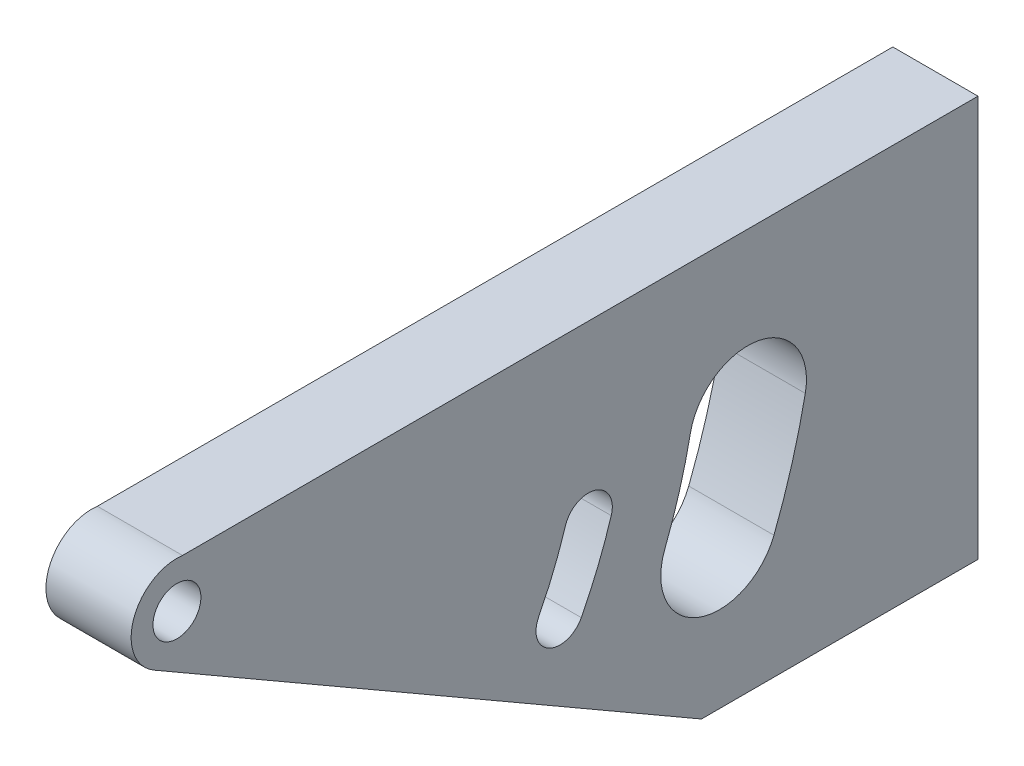
ISO-10303-21;
HEADER;
FILE_DESCRIPTION(('STEP AP214'),'2;1');
FILE_NAME('part.step','',(''),(''),'','','');
FILE_SCHEMA(('AUTOMOTIVE_DESIGN { 1 0 10303 214 1 1 1 1 }'));
ENDSEC;
DATA;
#1=APPLICATION_CONTEXT('core data for automotive mechanical design processes');
#2=APPLICATION_PROTOCOL_DEFINITION('international standard','automotive_design',2000,#1);
#3=PRODUCT_CONTEXT('',#1,'mechanical');
#4=PRODUCT('Part','Part','',(#3));
#5=PRODUCT_RELATED_PRODUCT_CATEGORY('part','',(#4));
#6=PRODUCT_DEFINITION_FORMATION('','',#4);
#7=PRODUCT_DEFINITION_CONTEXT('part definition',#1,'design');
#8=PRODUCT_DEFINITION('design','',#6,#7);
#9=PRODUCT_DEFINITION_SHAPE('','',#8);
#10=(LENGTH_UNIT() NAMED_UNIT(*) SI_UNIT(.MILLI.,.METRE.));
#11=(NAMED_UNIT(*) PLANE_ANGLE_UNIT() SI_UNIT($,.RADIAN.));
#12=(NAMED_UNIT(*) SI_UNIT($,.STERADIAN.) SOLID_ANGLE_UNIT());
#13=UNCERTAINTY_MEASURE_WITH_UNIT(LENGTH_MEASURE(1.E-05),#10,'distance_accuracy_value','');
#14=(GEOMETRIC_REPRESENTATION_CONTEXT(3) GLOBAL_UNCERTAINTY_ASSIGNED_CONTEXT((#13)) GLOBAL_UNIT_ASSIGNED_CONTEXT((#10,
#11,#12)) REPRESENTATION_CONTEXT('',''));
#15=CARTESIAN_POINT('',(0.,0.,0.));
#16=DIRECTION('',(0.,0.,1.));
#17=DIRECTION('',(1.,0.,0.));
#18=AXIS2_PLACEMENT_3D('',#15,#16,#17);
#19=CARTESIAN_POINT('',(0.,31.4020811412238,74.22));
#20=DIRECTION('',(1.,0.,0.));
#21=DIRECTION('',(0.,0.,-1.));
#22=AXIS2_PLACEMENT_3D('',#19,#20,#21);
#23=PLANE('',#22);
#24=CARTESIAN_POINT('',(0.,31.4020811412238,74.22));
#25=DIRECTION('',(1.,0.,0.));
#26=DIRECTION('',(0.,0.,-1.));
#27=AXIS2_PLACEMENT_3D('',#24,#25,#26);
#28=CIRCLE('',#27,2.24999999999999);
#29=CARTESIAN_POINT('',(0.,31.4020811412238,71.97));
#30=VERTEX_POINT('',#29);
#31=EDGE_CURVE('E183',#30,#30,#28,.T.);
#32=ORIENTED_EDGE('',*,*,#31,.F.);
#33=EDGE_LOOP('',(#32));
#34=FACE_BOUND('',#33,.T.);
#35=CARTESIAN_POINT('',(0.,19.4436475974425,35.5885430357724));
#36=DIRECTION('',(1.,0.,0.));
#37=DIRECTION('',(0.,0.,-1.));
#38=AXIS2_PLACEMENT_3D('',#35,#36,#37);
#39=CIRCLE('',#38,2.25);
#40=CARTESIAN_POINT('',(0.,18.7783044848434,33.4391667209971));
#41=VERTEX_POINT('',#40);
#42=CARTESIAN_POINT('',(0.,20.1089907100416,37.7379193505477));
#43=VERTEX_POINT('',#42);
#44=EDGE_CURVE('E212',#41,#43,#39,.T.);
#45=ORIENTED_EDGE('',*,*,#44,.F.);
#46=CARTESIAN_POINT('',(0.,31.4020811412237,74.22));
#47=DIRECTION('',(1.,0.,0.));
#48=DIRECTION('',(0.,0.,-1.));
#49=AXIS2_PLACEMENT_3D('',#46,#47,#48);
#50=CIRCLE('',#49,42.69);
#51=CARTESIAN_POINT('',(0.,11.8885706350881,36.2508150241945));
#52=VERTEX_POINT('',#51);
#53=EDGE_CURVE('E222',#52,#41,#50,.T.);
#54=ORIENTED_EDGE('',*,*,#53,.F.);
#55=CARTESIAN_POINT('',(0.,12.9170409709702,38.2520018640999));
#56=DIRECTION('',(1.,0.,0.));
#57=DIRECTION('',(0.,0.,-1.));
#58=AXIS2_PLACEMENT_3D('',#55,#56,#57);
#59=CIRCLE('',#58,2.24999999999999);
#60=CARTESIAN_POINT('',(0.,13.9455113068522,40.2531887040053));
#61=VERTEX_POINT('',#60);
#62=EDGE_CURVE('E236',#61,#52,#59,.T.);
#63=ORIENTED_EDGE('',*,*,#62,.F.);
#64=CARTESIAN_POINT('',(0.,31.4020811412237,74.22));
#65=DIRECTION('',(-1.,0.,0.));
#66=DIRECTION('',(0.,0.,1.));
#67=AXIS2_PLACEMENT_3D('',#64,#65,#66);
#68=CIRCLE('',#67,38.19);
#69=EDGE_CURVE('E233',#43,#61,#68,.T.);
#70=ORIENTED_EDGE('',*,*,#69,.F.);
#71=EDGE_LOOP('',(#45,#54,#63,#70));
#72=FACE_BOUND('',#71,.T.);
#73=DIRECTION('',(0.,0.,1.));
#74=VECTOR('',#73,1.);
#75=CARTESIAN_POINT('',(0.,-2.,13.96));
#76=LINE('',#75,#74);
#77=CARTESIAN_POINT('',(0.,-2.,-1.));
#78=VERTEX_POINT('',#77);
#79=CARTESIAN_POINT('',(0.,-2.,24.9658983848623));
#80=VERTEX_POINT('',#79);
#81=EDGE_CURVE('E260',#78,#80,#76,.T.);
#82=ORIENTED_EDGE('',*,*,#81,.F.);
#83=DIRECTION('',(0.,-1.,0.));
#84=VECTOR('',#83,1.);
#85=CARTESIAN_POINT('',(0.,35.6697455676984,-1.));
#86=LINE('',#85,#84);
#87=CARTESIAN_POINT('',(0.,35.6697455676984,-1.));
#88=VERTEX_POINT('',#87);
#89=EDGE_CURVE('E174',#88,#78,#86,.T.);
#90=ORIENTED_EDGE('',*,*,#89,.F.);
#91=DIRECTION('',(0.,0.,1.));
#92=VECTOR('',#91,1.);
#93=CARTESIAN_POINT('',(0.,35.6697455676984,24.9658983848623));
#94=LINE('',#93,#92);
#95=CARTESIAN_POINT('',(0.,35.6697455676984,73.6936537802901));
#96=VERTEX_POINT('',#95);
#97=EDGE_CURVE('E262',#88,#96,#94,.T.);
#98=ORIENTED_EDGE('',*,*,#97,.T.);
#99=CARTESIAN_POINT('',(0.,31.4020811412238,74.22));
#100=DIRECTION('',(1.,0.,0.));
#101=DIRECTION('',(0.,0.,-1.));
#102=AXIS2_PLACEMENT_3D('',#99,#100,#101);
#103=CIRCLE('',#102,4.3);
#104=CARTESIAN_POINT('',(0.,27.6781719049507,76.37));
#105=VERTEX_POINT('',#104);
#106=EDGE_CURVE('E266',#96,#105,#103,.T.);
#107=ORIENTED_EDGE('',*,*,#106,.T.);
#108=DIRECTION('',(0.,0.500000000000001,0.866025403784438));
#109=VECTOR('',#108,1.);
#110=CARTESIAN_POINT('',(0.,27.6781719049507,76.37));
#111=LINE('',#110,#109);
#112=EDGE_CURVE('E14',#80,#105,#111,.T.);
#113=ORIENTED_EDGE('',*,*,#112,.F.);
#114=EDGE_LOOP('',(#82,#90,#98,#107,#113));
#115=FACE_BOUND('',#114,.T.);
#116=CARTESIAN_POINT('',(0.,20.6897054354853,20.6097966172567));
#117=DIRECTION('',(1.,0.,0.));
#118=DIRECTION('',(0.,0.,-1.));
#119=AXIS2_PLACEMENT_3D('',#116,#117,#118);
#120=CIRCLE('',#119,5.5);
#121=CARTESIAN_POINT('',(0.,19.6120016421514,15.2164159952503));
#122=VERTEX_POINT('',#121);
#123=CARTESIAN_POINT('',(0.,21.7674092288191,26.003177239263));
#124=VERTEX_POINT('',#123);
#125=EDGE_CURVE('E67',#122,#124,#120,.T.);
#126=ORIENTED_EDGE('',*,*,#125,.F.);
#127=CARTESIAN_POINT('',(0.,31.4020811412238,74.22));
#128=DIRECTION('',(1.,0.,0.));
#129=DIRECTION('',(0.,0.,-1.));
#130=AXIS2_PLACEMENT_3D('',#127,#128,#129);
#131=CIRCLE('',#130,60.17);
#132=CARTESIAN_POINT('',(0.,9.5452546036646,18.1601388361775));
#133=VERTEX_POINT('',#132);
#134=EDGE_CURVE('E193',#133,#122,#131,.T.);
#135=ORIENTED_EDGE('',*,*,#134,.F.);
#136=CARTESIAN_POINT('',(0.,11.543136371266,23.284440587898));
#137=DIRECTION('',(1.,0.,0.));
#138=DIRECTION('',(0.,0.,-1.));
#139=AXIS2_PLACEMENT_3D('',#136,#137,#138);
#140=CIRCLE('',#139,5.50000000000001);
#141=CARTESIAN_POINT('',(0.,13.5410181388674,28.4087423396186));
#142=VERTEX_POINT('',#141);
#143=EDGE_CURVE('E205',#142,#133,#140,.T.);
#144=ORIENTED_EDGE('',*,*,#143,.F.);
#145=CARTESIAN_POINT('',(0.,31.4020811412238,74.22));
#146=DIRECTION('',(-1.,0.,0.));
#147=DIRECTION('',(0.,0.,1.));
#148=AXIS2_PLACEMENT_3D('',#145,#146,#147);
#149=CIRCLE('',#148,49.17);
#150=EDGE_CURVE('E202',#124,#142,#149,.T.);
#151=ORIENTED_EDGE('',*,*,#150,.F.);
#152=EDGE_LOOP('',(#126,#135,#144,#151));
#153=FACE_BOUND('',#152,.T.);
#154=ADVANCED_FACE('F51',(#34,#72,#115,#153),#23,.T.);
#155=CARTESIAN_POINT('',(-7.99999999999999,31.4020811412238,74.22));
#156=DIRECTION('',(-1.,0.,0.));
#157=DIRECTION('',(0.,0.,1.));
#158=AXIS2_PLACEMENT_3D('',#155,#156,#157);
#159=PLANE('',#158);
#160=CARTESIAN_POINT('',(-8.,31.4020811412238,74.22));
#161=DIRECTION('',(1.,0.,0.));
#162=DIRECTION('',(0.,0.,-1.));
#163=AXIS2_PLACEMENT_3D('',#160,#161,#162);
#164=CIRCLE('',#163,2.25);
#165=CARTESIAN_POINT('',(-8.,31.4020811412238,71.97));
#166=VERTEX_POINT('',#165);
#167=EDGE_CURVE('E186',#166,#166,#164,.T.);
#168=ORIENTED_EDGE('',*,*,#167,.T.);
#169=EDGE_LOOP('',(#168));
#170=FACE_BOUND('',#169,.T.);
#171=CARTESIAN_POINT('',(-8.,19.4436475974425,35.5885430357724));
#172=DIRECTION('',(1.,0.,0.));
#173=DIRECTION('',(0.,0.,-1.));
#174=AXIS2_PLACEMENT_3D('',#171,#172,#173);
#175=CIRCLE('',#174,2.25);
#176=CARTESIAN_POINT('',(-8.,18.7783044848434,33.4391667209971));
#177=VERTEX_POINT('',#176);
#178=CARTESIAN_POINT('',(-8.,20.1089907100416,37.7379193505477));
#179=VERTEX_POINT('',#178);
#180=EDGE_CURVE('E218',#177,#179,#175,.T.);
#181=ORIENTED_EDGE('',*,*,#180,.T.);
#182=CARTESIAN_POINT('',(-8.,31.4020811412237,74.22));
#183=DIRECTION('',(-1.,0.,0.));
#184=DIRECTION('',(0.,0.,1.));
#185=AXIS2_PLACEMENT_3D('',#182,#183,#184);
#186=CIRCLE('',#185,38.19);
#187=CARTESIAN_POINT('',(-7.99999999999999,13.9455113068522,40.2531887040053));
#188=VERTEX_POINT('',#187);
#189=EDGE_CURVE('E221',#179,#188,#186,.T.);
#190=ORIENTED_EDGE('',*,*,#189,.T.);
#191=CARTESIAN_POINT('',(-8.,12.9170409709702,38.2520018640999));
#192=DIRECTION('',(1.,0.,0.));
#193=DIRECTION('',(0.,0.,-1.));
#194=AXIS2_PLACEMENT_3D('',#191,#192,#193);
#195=CIRCLE('',#194,2.24999999999999);
#196=CARTESIAN_POINT('',(-8.,11.8885706350881,36.2508150241945));
#197=VERTEX_POINT('',#196);
#198=EDGE_CURVE('E225',#188,#197,#195,.T.);
#199=ORIENTED_EDGE('',*,*,#198,.T.);
#200=CARTESIAN_POINT('',(-8.,31.4020811412237,74.22));
#201=DIRECTION('',(1.,0.,0.));
#202=DIRECTION('',(0.,0.,-1.));
#203=AXIS2_PLACEMENT_3D('',#200,#201,#202);
#204=CIRCLE('',#203,42.69);
#205=EDGE_CURVE('E228',#197,#177,#204,.T.);
#206=ORIENTED_EDGE('',*,*,#205,.T.);
#207=EDGE_LOOP('',(#181,#190,#199,#206));
#208=FACE_BOUND('',#207,.T.);
#209=CARTESIAN_POINT('',(-7.99999999999999,31.4020811412238,74.22));
#210=DIRECTION('',(-1.,0.,0.));
#211=DIRECTION('',(0.,0.,1.));
#212=AXIS2_PLACEMENT_3D('',#209,#210,#211);
#213=CIRCLE('',#212,4.29999999999998);
#214=CARTESIAN_POINT('',(-7.99999999999999,27.6781719049507,76.37));
#215=VERTEX_POINT('',#214);
#216=CARTESIAN_POINT('',(-7.99999999999999,35.6697455676984,73.6936537802901));
#217=VERTEX_POINT('',#216);
#218=EDGE_CURVE('E243',#215,#217,#213,.T.);
#219=ORIENTED_EDGE('',*,*,#218,.T.);
#220=DIRECTION('',(0.,0.,-1.));
#221=VECTOR('',#220,1.);
#222=CARTESIAN_POINT('',(-7.99999999999999,35.6697455676984,73.6936537802901));
#223=LINE('',#222,#221);
#224=CARTESIAN_POINT('',(-8.,35.6697455676984,-1.));
#225=VERTEX_POINT('',#224);
#226=EDGE_CURVE('E252',#217,#225,#223,.T.);
#227=ORIENTED_EDGE('',*,*,#226,.T.);
#228=DIRECTION('',(0.,1.,0.));
#229=VECTOR('',#228,1.);
#230=CARTESIAN_POINT('',(-8.,-2.,-1.));
#231=LINE('',#230,#229);
#232=CARTESIAN_POINT('',(-8.,-2.,-1.));
#233=VERTEX_POINT('',#232);
#234=EDGE_CURVE('E180',#233,#225,#231,.T.);
#235=ORIENTED_EDGE('',*,*,#234,.F.);
#236=DIRECTION('',(0.,0.,1.));
#237=VECTOR('',#236,1.);
#238=CARTESIAN_POINT('',(-8.,-2.,0.));
#239=LINE('',#238,#237);
#240=CARTESIAN_POINT('',(-8.,-2.,24.9658983848623));
#241=VERTEX_POINT('',#240);
#242=EDGE_CURVE('E254',#233,#241,#239,.T.);
#243=ORIENTED_EDGE('',*,*,#242,.T.);
#244=DIRECTION('',(0.,0.500000000000001,0.866025403784438));
#245=VECTOR('',#244,1.);
#246=CARTESIAN_POINT('',(-8.,-2.,24.9658983848623));
#247=LINE('',#246,#245);
#248=EDGE_CURVE('E257',#241,#215,#247,.T.);
#249=ORIENTED_EDGE('',*,*,#248,.T.);
#250=EDGE_LOOP('',(#219,#227,#235,#243,#249));
#251=FACE_BOUND('',#250,.T.);
#252=CARTESIAN_POINT('',(-8.,20.6897054354853,20.6097966172567));
#253=DIRECTION('',(1.,0.,0.));
#254=DIRECTION('',(0.,0.,-1.));
#255=AXIS2_PLACEMENT_3D('',#252,#253,#254);
#256=CIRCLE('',#255,5.5);
#257=CARTESIAN_POINT('',(-8.,19.6120016421514,15.2164159952503));
#258=VERTEX_POINT('',#257);
#259=CARTESIAN_POINT('',(-8.,21.7674092288191,26.003177239263));
#260=VERTEX_POINT('',#259);
#261=EDGE_CURVE('E189',#258,#260,#256,.T.);
#262=ORIENTED_EDGE('',*,*,#261,.T.);
#263=CARTESIAN_POINT('',(-8.,31.4020811412238,74.22));
#264=DIRECTION('',(-1.,0.,0.));
#265=DIRECTION('',(0.,0.,1.));
#266=AXIS2_PLACEMENT_3D('',#263,#264,#265);
#267=CIRCLE('',#266,49.17);
#268=CARTESIAN_POINT('',(-8.,13.5410181388674,28.4087423396186));
#269=VERTEX_POINT('',#268);
#270=EDGE_CURVE('E192',#260,#269,#267,.T.);
#271=ORIENTED_EDGE('',*,*,#270,.T.);
#272=CARTESIAN_POINT('',(-8.,11.543136371266,23.284440587898));
#273=DIRECTION('',(1.,0.,0.));
#274=DIRECTION('',(0.,0.,-1.));
#275=AXIS2_PLACEMENT_3D('',#272,#273,#274);
#276=CIRCLE('',#275,5.50000000000001);
#277=CARTESIAN_POINT('',(-8.,9.5452546036646,18.1601388361775));
#278=VERTEX_POINT('',#277);
#279=EDGE_CURVE('E75',#269,#278,#276,.T.);
#280=ORIENTED_EDGE('',*,*,#279,.T.);
#281=CARTESIAN_POINT('',(-8.,31.4020811412238,74.22));
#282=DIRECTION('',(1.,0.,0.));
#283=DIRECTION('',(0.,0.,-1.));
#284=AXIS2_PLACEMENT_3D('',#281,#282,#283);
#285=CIRCLE('',#284,60.17);
#286=EDGE_CURVE('E197',#278,#258,#285,.T.);
#287=ORIENTED_EDGE('',*,*,#286,.T.);
#288=EDGE_LOOP('',(#262,#271,#280,#287));
#289=FACE_BOUND('',#288,.T.);
#290=ADVANCED_FACE('F283',(#170,#208,#251,#289),#159,.T.);
#291=CARTESIAN_POINT('',(0.,27.6781719049507,76.37));
#292=DIRECTION('',(0.,0.866025403784441,-0.499999999999996));
#293=DIRECTION('',(0.,0.499999999999996,0.866025403784441));
#294=AXIS2_PLACEMENT_3D('',#291,#292,#293);
#295=PLANE('',#294);
#296=ORIENTED_EDGE('',*,*,#112,.T.);
#297=DIRECTION('',(1.,0.,0.));
#298=VECTOR('',#297,1.);
#299=CARTESIAN_POINT('',(0.,27.6781719049507,76.37));
#300=LINE('',#299,#298);
#301=EDGE_CURVE('E55',#215,#105,#300,.T.);
#302=ORIENTED_EDGE('',*,*,#301,.F.);
#303=ORIENTED_EDGE('',*,*,#248,.F.);
#304=DIRECTION('',(-1.,0.,0.));
#305=VECTOR('',#304,1.);
#306=CARTESIAN_POINT('',(0.,-2.,24.9658983848623));
#307=LINE('',#306,#305);
#308=EDGE_CURVE('E264',#80,#241,#307,.T.);
#309=ORIENTED_EDGE('',*,*,#308,.F.);
#310=EDGE_LOOP('',(#296,#302,#303,#309));
#311=FACE_BOUND('',#310,.T.);
#312=ADVANCED_FACE('F279',(#311),#295,.F.);
#313=CARTESIAN_POINT('',(0.,31.4020811412238,74.22));
#314=DIRECTION('',(1.,0.,0.));
#315=DIRECTION('',(0.,0.,-1.));
#316=AXIS2_PLACEMENT_3D('',#313,#314,#315);
#317=CYLINDRICAL_SURFACE('',#316,4.3);
#318=ORIENTED_EDGE('',*,*,#106,.F.);
#319=DIRECTION('',(1.,0.,0.));
#320=VECTOR('',#319,1.);
#321=CARTESIAN_POINT('',(0.,35.6697455676984,73.6936537802901));
#322=LINE('',#321,#320);
#323=EDGE_CURVE('E268',#217,#96,#322,.T.);
#324=ORIENTED_EDGE('',*,*,#323,.F.);
#325=ORIENTED_EDGE('',*,*,#218,.F.);
#326=ORIENTED_EDGE('',*,*,#301,.T.);
#327=EDGE_LOOP('',(#318,#324,#325,#326));
#328=FACE_BOUND('',#327,.T.);
#329=ADVANCED_FACE('F276',(#328),#317,.T.);
#330=CARTESIAN_POINT('',(0.,35.6697455676984,0.));
#331=DIRECTION('',(0.,-1.,0.));
#332=DIRECTION('',(0.,0.,-1.));
#333=AXIS2_PLACEMENT_3D('',#330,#331,#332);
#334=PLANE('',#333);
#335=ORIENTED_EDGE('',*,*,#97,.F.);
#336=DIRECTION('',(1.,0.,0.));
#337=VECTOR('',#336,1.);
#338=CARTESIAN_POINT('',(-8.,35.6697455676984,-1.));
#339=LINE('',#338,#337);
#340=EDGE_CURVE('E171',#225,#88,#339,.T.);
#341=ORIENTED_EDGE('',*,*,#340,.F.);
#342=ORIENTED_EDGE('',*,*,#226,.F.);
#343=ORIENTED_EDGE('',*,*,#323,.T.);
#344=EDGE_LOOP('',(#335,#341,#342,#343));
#345=FACE_BOUND('',#344,.T.);
#346=ADVANCED_FACE('F53',(#345),#334,.F.);
#347=CARTESIAN_POINT('',(-2.,-2.,73.6936537802901));
#348=DIRECTION('',(0.,-1.,0.));
#349=DIRECTION('',(0.,0.,-1.));
#350=AXIS2_PLACEMENT_3D('',#347,#348,#349);
#351=PLANE('',#350);
#352=ORIENTED_EDGE('',*,*,#242,.F.);
#353=DIRECTION('',(-1.,0.,0.));
#354=VECTOR('',#353,1.);
#355=CARTESIAN_POINT('',(0.,-2.,-1.));
#356=LINE('',#355,#354);
#357=EDGE_CURVE('E177',#78,#233,#356,.T.);
#358=ORIENTED_EDGE('',*,*,#357,.F.);
#359=ORIENTED_EDGE('',*,*,#81,.T.);
#360=ORIENTED_EDGE('',*,*,#308,.T.);
#361=EDGE_LOOP('',(#352,#358,#359,#360));
#362=FACE_BOUND('',#361,.T.);
#363=ADVANCED_FACE('F288',(#362),#351,.T.);
#364=CARTESIAN_POINT('',(-8.,19.4436475974425,35.5885430357724));
#365=DIRECTION('',(1.,0.,0.));
#366=DIRECTION('',(0.,0.,-1.));
#367=AXIS2_PLACEMENT_3D('',#364,#365,#366);
#368=CYLINDRICAL_SURFACE('',#367,2.25);
#369=ORIENTED_EDGE('',*,*,#44,.T.);
#370=DIRECTION('',(1.,0.,0.));
#371=VECTOR('',#370,1.);
#372=CARTESIAN_POINT('',(-8.,20.1089907100416,37.7379193505477));
#373=LINE('',#372,#371);
#374=EDGE_CURVE('E231',#179,#43,#373,.T.);
#375=ORIENTED_EDGE('',*,*,#374,.F.);
#376=ORIENTED_EDGE('',*,*,#180,.F.);
#377=DIRECTION('',(1.,0.,0.));
#378=VECTOR('',#377,1.);
#379=CARTESIAN_POINT('',(-8.,18.7783044848434,33.4391667209971));
#380=LINE('',#379,#378);
#381=EDGE_CURVE('E241',#177,#41,#380,.T.);
#382=ORIENTED_EDGE('',*,*,#381,.T.);
#383=EDGE_LOOP('',(#369,#375,#376,#382));
#384=FACE_BOUND('',#383,.T.);
#385=ADVANCED_FACE('F300',(#384),#368,.F.);
#386=CARTESIAN_POINT('',(-8.,31.4020811412237,74.22));
#387=DIRECTION('',(1.,0.,0.));
#388=DIRECTION('',(0.,0.,-1.));
#389=AXIS2_PLACEMENT_3D('',#386,#387,#388);
#390=CYLINDRICAL_SURFACE('',#389,42.69);
#391=ORIENTED_EDGE('',*,*,#53,.T.);
#392=ORIENTED_EDGE('',*,*,#381,.F.);
#393=ORIENTED_EDGE('',*,*,#205,.F.);
#394=DIRECTION('',(1.,0.,0.));
#395=VECTOR('',#394,1.);
#396=CARTESIAN_POINT('',(-8.,11.8885706350881,36.2508150241945));
#397=LINE('',#396,#395);
#398=EDGE_CURVE('E244',#197,#52,#397,.T.);
#399=ORIENTED_EDGE('',*,*,#398,.T.);
#400=EDGE_LOOP('',(#391,#392,#393,#399));
#401=FACE_BOUND('',#400,.T.);
#402=ADVANCED_FACE('F317',(#401),#390,.F.);
#403=CARTESIAN_POINT('',(-8.,12.9170409709702,38.2520018640999));
#404=DIRECTION('',(1.,0.,0.));
#405=DIRECTION('',(0.,0.,-1.));
#406=AXIS2_PLACEMENT_3D('',#403,#404,#405);
#407=CYLINDRICAL_SURFACE('',#406,2.24999999999999);
#408=ORIENTED_EDGE('',*,*,#62,.T.);
#409=ORIENTED_EDGE('',*,*,#398,.F.);
#410=ORIENTED_EDGE('',*,*,#198,.F.);
#411=DIRECTION('',(1.,0.,0.));
#412=VECTOR('',#411,1.);
#413=CARTESIAN_POINT('',(-8.,13.9455113068522,40.2531887040053));
#414=LINE('',#413,#412);
#415=EDGE_CURVE('E246',#188,#61,#414,.T.);
#416=ORIENTED_EDGE('',*,*,#415,.T.);
#417=EDGE_LOOP('',(#408,#409,#410,#416));
#418=FACE_BOUND('',#417,.T.);
#419=ADVANCED_FACE('F323',(#418),#407,.F.);
#420=CARTESIAN_POINT('',(-8.,31.4020811412237,74.22));
#421=DIRECTION('',(1.,0.,0.));
#422=DIRECTION('',(0.,0.,-1.));
#423=AXIS2_PLACEMENT_3D('',#420,#421,#422);
#424=CYLINDRICAL_SURFACE('',#423,38.19);
#425=ORIENTED_EDGE('',*,*,#69,.T.);
#426=ORIENTED_EDGE('',*,*,#415,.F.);
#427=ORIENTED_EDGE('',*,*,#189,.F.);
#428=ORIENTED_EDGE('',*,*,#374,.T.);
#429=EDGE_LOOP('',(#425,#426,#427,#428));
#430=FACE_BOUND('',#429,.T.);
#431=ADVANCED_FACE('F327',(#430),#424,.T.);
#432=CARTESIAN_POINT('',(-8.,20.6897054354853,20.6097966172567));
#433=DIRECTION('',(1.,0.,0.));
#434=DIRECTION('',(0.,0.,-1.));
#435=AXIS2_PLACEMENT_3D('',#432,#433,#434);
#436=CYLINDRICAL_SURFACE('',#435,5.5);
#437=ORIENTED_EDGE('',*,*,#125,.T.);
#438=DIRECTION('',(1.,0.,0.));
#439=VECTOR('',#438,1.);
#440=CARTESIAN_POINT('',(-8.,21.7674092288191,26.003177239263));
#441=LINE('',#440,#439);
#442=EDGE_CURVE('E200',#260,#124,#441,.T.);
#443=ORIENTED_EDGE('',*,*,#442,.F.);
#444=ORIENTED_EDGE('',*,*,#261,.F.);
#445=DIRECTION('',(1.,0.,0.));
#446=VECTOR('',#445,1.);
#447=CARTESIAN_POINT('',(-8.,19.6120016421514,15.2164159952503));
#448=LINE('',#447,#446);
#449=EDGE_CURVE('E210',#258,#122,#448,.T.);
#450=ORIENTED_EDGE('',*,*,#449,.T.);
#451=EDGE_LOOP('',(#437,#443,#444,#450));
#452=FACE_BOUND('',#451,.T.);
#453=ADVANCED_FACE('F330',(#452),#436,.F.);
#454=CARTESIAN_POINT('',(-8.,31.4020811412238,74.22));
#455=DIRECTION('',(1.,0.,0.));
#456=DIRECTION('',(0.,0.,-1.));
#457=AXIS2_PLACEMENT_3D('',#454,#455,#456);
#458=CYLINDRICAL_SURFACE('',#457,60.17);
#459=ORIENTED_EDGE('',*,*,#134,.T.);
#460=ORIENTED_EDGE('',*,*,#449,.F.);
#461=ORIENTED_EDGE('',*,*,#286,.F.);
#462=DIRECTION('',(1.,0.,0.));
#463=VECTOR('',#462,1.);
#464=CARTESIAN_POINT('',(-8.,9.5452546036646,18.1601388361775));
#465=LINE('',#464,#463);
#466=EDGE_CURVE('E213',#278,#133,#465,.T.);
#467=ORIENTED_EDGE('',*,*,#466,.T.);
#468=EDGE_LOOP('',(#459,#460,#461,#467));
#469=FACE_BOUND('',#468,.T.);
#470=ADVANCED_FACE('F337',(#469),#458,.F.);
#471=CARTESIAN_POINT('',(-8.,11.543136371266,23.284440587898));
#472=DIRECTION('',(1.,0.,0.));
#473=DIRECTION('',(0.,0.,-1.));
#474=AXIS2_PLACEMENT_3D('',#471,#472,#473);
#475=CYLINDRICAL_SURFACE('',#474,5.50000000000001);
#476=ORIENTED_EDGE('',*,*,#143,.T.);
#477=ORIENTED_EDGE('',*,*,#466,.F.);
#478=ORIENTED_EDGE('',*,*,#279,.F.);
#479=DIRECTION('',(1.,0.,0.));
#480=VECTOR('',#479,1.);
#481=CARTESIAN_POINT('',(-8.,13.5410181388674,28.4087423396186));
#482=LINE('',#481,#480);
#483=EDGE_CURVE('E215',#269,#142,#482,.T.);
#484=ORIENTED_EDGE('',*,*,#483,.T.);
#485=EDGE_LOOP('',(#476,#477,#478,#484));
#486=FACE_BOUND('',#485,.T.);
#487=ADVANCED_FACE('F342',(#486),#475,.F.);
#488=CARTESIAN_POINT('',(-8.,31.4020811412238,74.22));
#489=DIRECTION('',(1.,0.,0.));
#490=DIRECTION('',(0.,0.,-1.));
#491=AXIS2_PLACEMENT_3D('',#488,#489,#490);
#492=CYLINDRICAL_SURFACE('',#491,49.17);
#493=ORIENTED_EDGE('',*,*,#150,.T.);
#494=ORIENTED_EDGE('',*,*,#483,.F.);
#495=ORIENTED_EDGE('',*,*,#270,.F.);
#496=ORIENTED_EDGE('',*,*,#442,.T.);
#497=EDGE_LOOP('',(#493,#494,#495,#496));
#498=FACE_BOUND('',#497,.T.);
#499=ADVANCED_FACE('F338',(#498),#492,.T.);
#500=CARTESIAN_POINT('',(0.,31.4020811412238,74.22));
#501=DIRECTION('',(1.,0.,0.));
#502=DIRECTION('',(0.,0.,-1.));
#503=AXIS2_PLACEMENT_3D('',#500,#501,#502);
#504=CYLINDRICAL_SURFACE('',#503,2.25);
#505=ORIENTED_EDGE('',*,*,#167,.F.);
#506=EDGE_LOOP('',(#505));
#507=FACE_BOUND('',#506,.T.);
#508=ORIENTED_EDGE('',*,*,#31,.T.);
#509=EDGE_LOOP('',(#508));
#510=FACE_BOUND('',#509,.T.);
#511=ADVANCED_FACE('F341',(#507,#510),#504,.F.);
#512=CARTESIAN_POINT('',(0.,0.,-1.));
#513=DIRECTION('',(0.,0.,-1.));
#514=DIRECTION('',(-1.,0.,0.));
#515=AXIS2_PLACEMENT_3D('',#512,#513,#514);
#516=PLANE('',#515);
#517=CARTESIAN_POINT('',(-4.,29.3348727838492,-1.));
#518=DIRECTION('',(0.,0.,-1.));
#519=DIRECTION('',(-1.,0.,0.));
#520=AXIS2_PLACEMENT_3D('',#517,#518,#519);
#521=CIRCLE('',#520,2.1);
#522=CARTESIAN_POINT('',(-6.1,29.3348727838492,-1.));
#523=VERTEX_POINT('',#522);
#524=EDGE_CURVE('E161',#523,#523,#521,.T.);
#525=ORIENTED_EDGE('',*,*,#524,.F.);
#526=EDGE_LOOP('',(#525));
#527=FACE_BOUND('',#526,.T.);
#528=CARTESIAN_POINT('',(-4.,4.3348727838492,-1.));
#529=DIRECTION('',(0.,0.,-1.));
#530=DIRECTION('',(-1.,0.,0.));
#531=AXIS2_PLACEMENT_3D('',#528,#529,#530);
#532=CIRCLE('',#531,2.1);
#533=CARTESIAN_POINT('',(-6.1,4.3348727838492,-1.));
#534=VERTEX_POINT('',#533);
#535=EDGE_CURVE('E160',#534,#534,#532,.T.);
#536=ORIENTED_EDGE('',*,*,#535,.F.);
#537=EDGE_LOOP('',(#536));
#538=FACE_BOUND('',#537,.T.);
#539=ORIENTED_EDGE('',*,*,#340,.T.);
#540=ORIENTED_EDGE('',*,*,#89,.T.);
#541=ORIENTED_EDGE('',*,*,#357,.T.);
#542=ORIENTED_EDGE('',*,*,#234,.T.);
#543=EDGE_LOOP('',(#539,#540,#541,#542));
#544=FACE_BOUND('',#543,.T.);
#545=ADVANCED_FACE('F290',(#527,#538,#544),#516,.T.);
#546=CARTESIAN_POINT('',(-4.,4.3348727838492,13.));
#547=DIRECTION('',(0.,0.,-1.));
#548=DIRECTION('',(-1.,0.,0.));
#549=AXIS2_PLACEMENT_3D('',#546,#547,#548);
#550=CONICAL_SURFACE('',#549,2.1,1.02974425867665);
#551=CARTESIAN_POINT('',(-4.,4.3348727838492,14.2618072999579));
#552=VERTEX_POINT('',#551);
#553=VERTEX_LOOP('',#552);
#554=FACE_BOUND('',#553,.T.);
#555=CARTESIAN_POINT('',(-4.,4.3348727838492,13.));
#556=DIRECTION('',(0.,0.,-1.));
#557=DIRECTION('',(-1.,0.,0.));
#558=AXIS2_PLACEMENT_3D('',#555,#556,#557);
#559=CIRCLE('',#558,2.1);
#560=CARTESIAN_POINT('',(-6.1,4.3348727838492,13.));
#561=VERTEX_POINT('',#560);
#562=EDGE_CURVE('E164',#561,#561,#559,.T.);
#563=ORIENTED_EDGE('',*,*,#562,.T.);
#564=EDGE_LOOP('',(#563));
#565=FACE_BOUND('',#564,.T.);
#566=ADVANCED_FACE('F354',(#554,#565),#550,.F.);
#567=CARTESIAN_POINT('',(-4.,4.3348727838492,-1.));
#568=DIRECTION('',(0.,0.,-1.));
#569=DIRECTION('',(-1.,0.,0.));
#570=AXIS2_PLACEMENT_3D('',#567,#568,#569);
#571=CYLINDRICAL_SURFACE('',#570,2.1);
#572=ORIENTED_EDGE('',*,*,#562,.F.);
#573=EDGE_LOOP('',(#572));
#574=FACE_BOUND('',#573,.T.);
#575=ORIENTED_EDGE('',*,*,#535,.T.);
#576=EDGE_LOOP('',(#575));
#577=FACE_BOUND('',#576,.T.);
#578=ADVANCED_FACE('F154',(#574,#577),#571,.F.);
#579=CARTESIAN_POINT('',(-4.,29.3348727838492,13.));
#580=DIRECTION('',(0.,0.,-1.));
#581=DIRECTION('',(-1.,0.,0.));
#582=AXIS2_PLACEMENT_3D('',#579,#580,#581);
#583=CONICAL_SURFACE('',#582,2.1,1.02974425867665);
#584=CARTESIAN_POINT('',(-4.,29.3348727838492,14.2618072999579));
#585=VERTEX_POINT('',#584);
#586=VERTEX_LOOP('',#585);
#587=FACE_BOUND('',#586,.T.);
#588=CARTESIAN_POINT('',(-4.,29.3348727838492,13.));
#589=DIRECTION('',(0.,0.,-1.));
#590=DIRECTION('',(-1.,0.,0.));
#591=AXIS2_PLACEMENT_3D('',#588,#589,#590);
#592=CIRCLE('',#591,2.1);
#593=CARTESIAN_POINT('',(-6.1,29.3348727838492,13.));
#594=VERTEX_POINT('',#593);
#595=EDGE_CURVE('E158',#594,#594,#592,.T.);
#596=ORIENTED_EDGE('',*,*,#595,.T.);
#597=EDGE_LOOP('',(#596));
#598=FACE_BOUND('',#597,.T.);
#599=ADVANCED_FACE('F150',(#587,#598),#583,.F.);
#600=CARTESIAN_POINT('',(-4.,29.3348727838492,-1.));
#601=DIRECTION('',(0.,0.,-1.));
#602=DIRECTION('',(-1.,0.,0.));
#603=AXIS2_PLACEMENT_3D('',#600,#601,#602);
#604=CYLINDRICAL_SURFACE('',#603,2.1);
#605=ORIENTED_EDGE('',*,*,#595,.F.);
#606=EDGE_LOOP('',(#605));
#607=FACE_BOUND('',#606,.T.);
#608=ORIENTED_EDGE('',*,*,#524,.T.);
#609=EDGE_LOOP('',(#608));
#610=FACE_BOUND('',#609,.T.);
#611=ADVANCED_FACE('F153',(#607,#610),#604,.F.);
#612=CLOSED_SHELL('',(#154,#290,#312,#329,#346,#363,#385,#402,#419,#431,#453,#470,#487,#499,
#511,#545,#566,#578,#599,#611));
#613=MANIFOLD_SOLID_BREP('B2',#612);
#614=ADVANCED_BREP_SHAPE_REPRESENTATION('',(#18,#613),#14);
#615=SHAPE_DEFINITION_REPRESENTATION(#9,#614);
ENDSEC;
END-ISO-10303-21;
